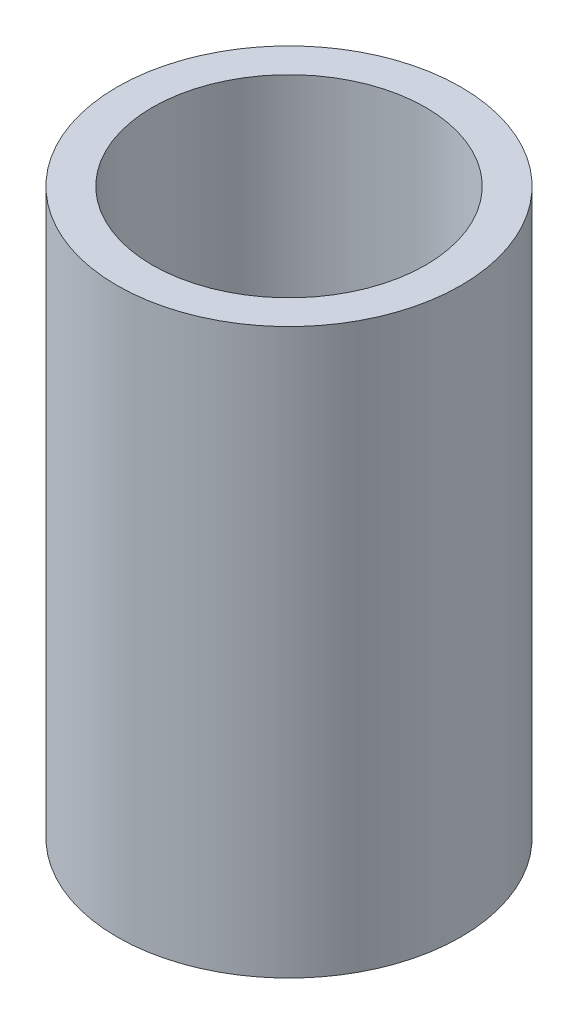
ISO-10303-21;
HEADER;
FILE_DESCRIPTION(('STEP AP214'),'2;1');
FILE_NAME('part.step','',(''),(''),'','','');
FILE_SCHEMA(('AUTOMOTIVE_DESIGN { 1 0 10303 214 1 1 1 1 }'));
ENDSEC;
DATA;
#1=APPLICATION_CONTEXT('core data for automotive mechanical design processes');
#2=APPLICATION_PROTOCOL_DEFINITION('international standard','automotive_design',2000,#1);
#3=PRODUCT_CONTEXT('',#1,'mechanical');
#4=PRODUCT('Part','Part','',(#3));
#5=PRODUCT_RELATED_PRODUCT_CATEGORY('part','',(#4));
#6=PRODUCT_DEFINITION_FORMATION('','',#4);
#7=PRODUCT_DEFINITION_CONTEXT('part definition',#1,'design');
#8=PRODUCT_DEFINITION('design','',#6,#7);
#9=PRODUCT_DEFINITION_SHAPE('','',#8);
#10=(LENGTH_UNIT() NAMED_UNIT(*) SI_UNIT(.MILLI.,.METRE.));
#11=(NAMED_UNIT(*) PLANE_ANGLE_UNIT() SI_UNIT($,.RADIAN.));
#12=(NAMED_UNIT(*) SI_UNIT($,.STERADIAN.) SOLID_ANGLE_UNIT());
#13=UNCERTAINTY_MEASURE_WITH_UNIT(LENGTH_MEASURE(1.E-05),#10,'distance_accuracy_value','');
#14=(GEOMETRIC_REPRESENTATION_CONTEXT(3) GLOBAL_UNCERTAINTY_ASSIGNED_CONTEXT((#13)) GLOBAL_UNIT_ASSIGNED_CONTEXT((#10,
#11,#12)) REPRESENTATION_CONTEXT('',''));
#15=CARTESIAN_POINT('',(0.,0.,0.));
#16=DIRECTION('',(0.,0.,1.));
#17=DIRECTION('',(1.,0.,0.));
#18=AXIS2_PLACEMENT_3D('',#15,#16,#17);
#19=CARTESIAN_POINT('',(0.,50.8,0.));
#20=DIRECTION('',(0.,-1.,0.));
#21=DIRECTION('',(0.,0.,-1.));
#22=AXIS2_PLACEMENT_3D('',#19,#20,#21);
#23=CYLINDRICAL_SURFACE('',#22,12.303125);
#24=CARTESIAN_POINT('',(0.,50.8,0.));
#25=DIRECTION('',(0.,1.,0.));
#26=DIRECTION('',(0.,0.,1.));
#27=AXIS2_PLACEMENT_3D('',#24,#25,#26);
#28=CIRCLE('',#27,12.303125);
#29=CARTESIAN_POINT('',(0.,50.8,12.303125));
#30=VERTEX_POINT('',#29);
#31=EDGE_CURVE('E40',#30,#30,#28,.T.);
#32=ORIENTED_EDGE('',*,*,#31,.T.);
#33=EDGE_LOOP('',(#32));
#34=FACE_BOUND('',#33,.T.);
#35=CARTESIAN_POINT('',(0.,0.,0.));
#36=DIRECTION('',(0.,1.,0.));
#37=DIRECTION('',(0.,0.,1.));
#38=AXIS2_PLACEMENT_3D('',#35,#36,#37);
#39=CIRCLE('',#38,12.303125);
#40=CARTESIAN_POINT('',(0.,0.,12.303125));
#41=VERTEX_POINT('',#40);
#42=EDGE_CURVE('E46',#41,#41,#39,.T.);
#43=ORIENTED_EDGE('',*,*,#42,.F.);
#44=EDGE_LOOP('',(#43));
#45=FACE_BOUND('',#44,.T.);
#46=ADVANCED_FACE('F33',(#34,#45),#23,.F.);
#47=CARTESIAN_POINT('',(0.,50.8,0.));
#48=DIRECTION('',(0.,-1.,0.));
#49=DIRECTION('',(0.,0.,-1.));
#50=AXIS2_PLACEMENT_3D('',#47,#48,#49);
#51=CYLINDRICAL_SURFACE('',#50,15.478125);
#52=CARTESIAN_POINT('',(0.,50.8,0.));
#53=DIRECTION('',(0.,1.,0.));
#54=DIRECTION('',(0.,0.,1.));
#55=AXIS2_PLACEMENT_3D('',#52,#53,#54);
#56=CIRCLE('',#55,15.478125);
#57=CARTESIAN_POINT('',(0.,50.8,15.478125));
#58=VERTEX_POINT('',#57);
#59=EDGE_CURVE('E10',#58,#58,#56,.T.);
#60=ORIENTED_EDGE('',*,*,#59,.F.);
#61=EDGE_LOOP('',(#60));
#62=FACE_BOUND('',#61,.T.);
#63=CARTESIAN_POINT('',(0.,0.,0.));
#64=DIRECTION('',(0.,1.,0.));
#65=DIRECTION('',(0.,0.,1.));
#66=AXIS2_PLACEMENT_3D('',#63,#64,#65);
#67=CIRCLE('',#66,15.478125);
#68=CARTESIAN_POINT('',(0.,0.,15.478125));
#69=VERTEX_POINT('',#68);
#70=EDGE_CURVE('E36',#69,#69,#67,.T.);
#71=ORIENTED_EDGE('',*,*,#70,.T.);
#72=EDGE_LOOP('',(#71));
#73=FACE_BOUND('',#72,.T.);
#74=ADVANCED_FACE('F53',(#62,#73),#51,.T.);
#75=CARTESIAN_POINT('',(0.,50.8,0.));
#76=DIRECTION('',(0.,1.,0.));
#77=DIRECTION('',(0.,0.,1.));
#78=AXIS2_PLACEMENT_3D('',#75,#76,#77);
#79=PLANE('',#78);
#80=ORIENTED_EDGE('',*,*,#31,.F.);
#81=EDGE_LOOP('',(#80));
#82=FACE_BOUND('',#81,.T.);
#83=ORIENTED_EDGE('',*,*,#59,.T.);
#84=EDGE_LOOP('',(#83));
#85=FACE_BOUND('',#84,.T.);
#86=ADVANCED_FACE('F57',(#82,#85),#79,.T.);
#87=CARTESIAN_POINT('',(0.,0.,0.));
#88=DIRECTION('',(0.,1.,0.));
#89=DIRECTION('',(0.,0.,1.));
#90=AXIS2_PLACEMENT_3D('',#87,#88,#89);
#91=PLANE('',#90);
#92=ORIENTED_EDGE('',*,*,#42,.T.);
#93=EDGE_LOOP('',(#92));
#94=FACE_BOUND('',#93,.T.);
#95=ORIENTED_EDGE('',*,*,#70,.F.);
#96=EDGE_LOOP('',(#95));
#97=FACE_BOUND('',#96,.T.);
#98=ADVANCED_FACE('F55',(#94,#97),#91,.F.);
#99=CLOSED_SHELL('',(#46,#74,#86,#98));
#100=MANIFOLD_SOLID_BREP('B2',#99);
#101=ADVANCED_BREP_SHAPE_REPRESENTATION('',(#18,#100),#14);
#102=SHAPE_DEFINITION_REPRESENTATION(#9,#101);
ENDSEC;
END-ISO-10303-21;
